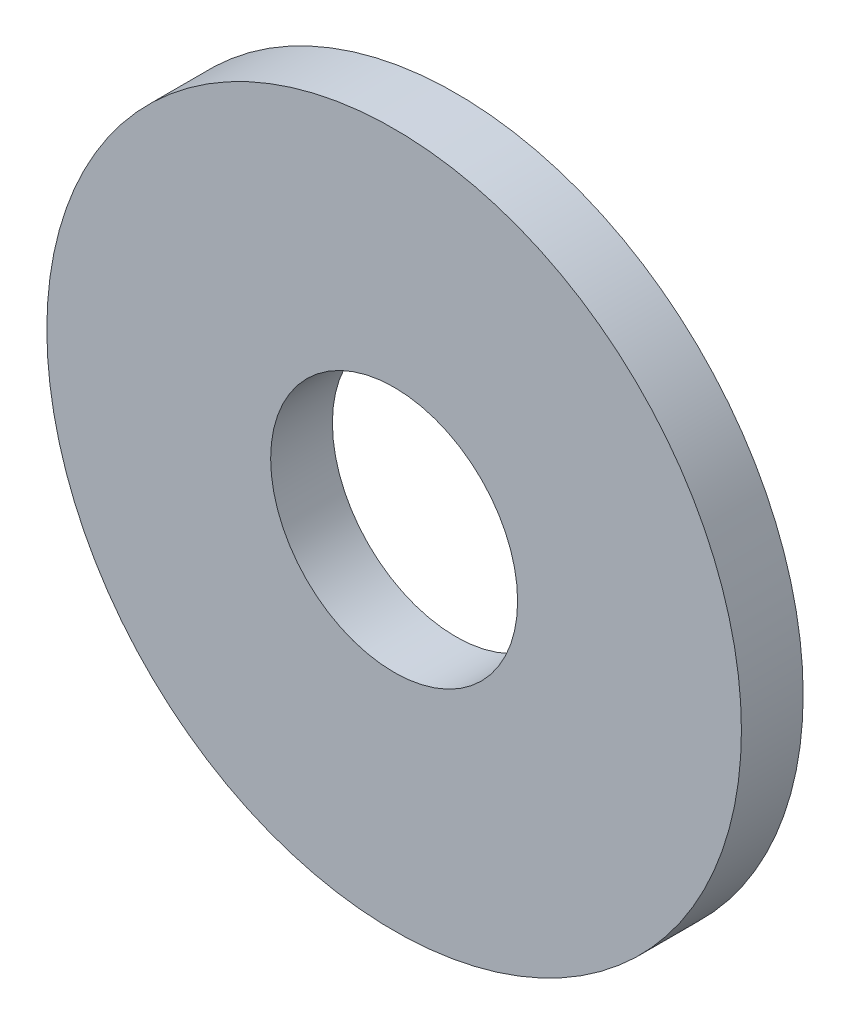
ISO-10303-21;
HEADER;
FILE_DESCRIPTION(('STEP AP214'),'2;1');
FILE_NAME('part.step','',(''),(''),'','','');
FILE_SCHEMA(('AUTOMOTIVE_DESIGN { 1 0 10303 214 1 1 1 1 }'));
ENDSEC;
DATA;
#1=APPLICATION_CONTEXT('core data for automotive mechanical design processes');
#2=APPLICATION_PROTOCOL_DEFINITION('international standard','automotive_design',2000,#1);
#3=PRODUCT_CONTEXT('',#1,'mechanical');
#4=PRODUCT('Part','Part','',(#3));
#5=PRODUCT_RELATED_PRODUCT_CATEGORY('part','',(#4));
#6=PRODUCT_DEFINITION_FORMATION('','',#4);
#7=PRODUCT_DEFINITION_CONTEXT('part definition',#1,'design');
#8=PRODUCT_DEFINITION('design','',#6,#7);
#9=PRODUCT_DEFINITION_SHAPE('','',#8);
#10=(LENGTH_UNIT() NAMED_UNIT(*) SI_UNIT(.MILLI.,.METRE.));
#11=(NAMED_UNIT(*) PLANE_ANGLE_UNIT() SI_UNIT($,.RADIAN.));
#12=(NAMED_UNIT(*) SI_UNIT($,.STERADIAN.) SOLID_ANGLE_UNIT());
#13=UNCERTAINTY_MEASURE_WITH_UNIT(LENGTH_MEASURE(1.E-05),#10,'distance_accuracy_value','');
#14=(GEOMETRIC_REPRESENTATION_CONTEXT(3) GLOBAL_UNCERTAINTY_ASSIGNED_CONTEXT((#13)) GLOBAL_UNIT_ASSIGNED_CONTEXT((#10,
#11,#12)) REPRESENTATION_CONTEXT('',''));
#15=CARTESIAN_POINT('',(0.,0.,0.));
#16=DIRECTION('',(0.,0.,1.));
#17=DIRECTION('',(1.,0.,0.));
#18=AXIS2_PLACEMENT_3D('',#15,#16,#17);
#19=CARTESIAN_POINT('',(0.,0.,0.4));
#20=DIRECTION('',(0.,0.,1.));
#21=DIRECTION('',(1.,0.,0.));
#22=AXIS2_PLACEMENT_3D('',#19,#20,#21);
#23=PLANE('',#22);
#24=CARTESIAN_POINT('',(0.,0.,0.4));
#25=DIRECTION('',(0.,0.,1.));
#26=DIRECTION('',(1.,0.,0.));
#27=AXIS2_PLACEMENT_3D('',#24,#25,#26);
#28=CIRCLE('',#27,4.5);
#29=CARTESIAN_POINT('',(4.5,0.,0.4));
#30=VERTEX_POINT('',#29);
#31=EDGE_CURVE('E10',#30,#30,#28,.T.);
#32=ORIENTED_EDGE('',*,*,#31,.T.);
#33=EDGE_LOOP('',(#32));
#34=FACE_BOUND('',#33,.T.);
#35=CARTESIAN_POINT('',(0.,0.,0.4));
#36=DIRECTION('',(0.,0.,1.));
#37=DIRECTION('',(1.,0.,0.));
#38=AXIS2_PLACEMENT_3D('',#35,#36,#37);
#39=CIRCLE('',#38,1.6);
#40=CARTESIAN_POINT('',(1.6,0.,0.4));
#41=VERTEX_POINT('',#40);
#42=EDGE_CURVE('E44',#41,#41,#39,.T.);
#43=ORIENTED_EDGE('',*,*,#42,.F.);
#44=EDGE_LOOP('',(#43));
#45=FACE_BOUND('',#44,.T.);
#46=ADVANCED_FACE('F33',(#34,#45),#23,.T.);
#47=CARTESIAN_POINT('',(0.,0.,-0.4));
#48=DIRECTION('',(0.,0.,1.));
#49=DIRECTION('',(1.,0.,0.));
#50=AXIS2_PLACEMENT_3D('',#47,#48,#49);
#51=PLANE('',#50);
#52=CARTESIAN_POINT('',(0.,0.,-0.4));
#53=DIRECTION('',(0.,0.,1.));
#54=DIRECTION('',(1.,0.,0.));
#55=AXIS2_PLACEMENT_3D('',#52,#53,#54);
#56=CIRCLE('',#55,4.5);
#57=CARTESIAN_POINT('',(4.5,0.,-0.4));
#58=VERTEX_POINT('',#57);
#59=EDGE_CURVE('E37',#58,#58,#56,.T.);
#60=ORIENTED_EDGE('',*,*,#59,.F.);
#61=EDGE_LOOP('',(#60));
#62=FACE_BOUND('',#61,.T.);
#63=CARTESIAN_POINT('',(0.,0.,-0.4));
#64=DIRECTION('',(0.,0.,1.));
#65=DIRECTION('',(1.,0.,0.));
#66=AXIS2_PLACEMENT_3D('',#63,#64,#65);
#67=CIRCLE('',#66,1.6);
#68=CARTESIAN_POINT('',(1.6,0.,-0.4));
#69=VERTEX_POINT('',#68);
#70=EDGE_CURVE('E46',#69,#69,#67,.T.);
#71=ORIENTED_EDGE('',*,*,#70,.T.);
#72=EDGE_LOOP('',(#71));
#73=FACE_BOUND('',#72,.T.);
#74=ADVANCED_FACE('F56',(#62,#73),#51,.F.);
#75=CARTESIAN_POINT('',(0.,0.,0.4));
#76=DIRECTION('',(0.,0.,-1.));
#77=DIRECTION('',(-1.,0.,0.));
#78=AXIS2_PLACEMENT_3D('',#75,#76,#77);
#79=CYLINDRICAL_SURFACE('',#78,4.5);
#80=ORIENTED_EDGE('',*,*,#31,.F.);
#81=EDGE_LOOP('',(#80));
#82=FACE_BOUND('',#81,.T.);
#83=ORIENTED_EDGE('',*,*,#59,.T.);
#84=EDGE_LOOP('',(#83));
#85=FACE_BOUND('',#84,.T.);
#86=ADVANCED_FACE('F35',(#82,#85),#79,.T.);
#87=CARTESIAN_POINT('',(0.,0.,0.4));
#88=DIRECTION('',(0.,0.,-1.));
#89=DIRECTION('',(-1.,0.,0.));
#90=AXIS2_PLACEMENT_3D('',#87,#88,#89);
#91=CYLINDRICAL_SURFACE('',#90,1.6);
#92=ORIENTED_EDGE('',*,*,#42,.T.);
#93=EDGE_LOOP('',(#92));
#94=FACE_BOUND('',#93,.T.);
#95=ORIENTED_EDGE('',*,*,#70,.F.);
#96=EDGE_LOOP('',(#95));
#97=FACE_BOUND('',#96,.T.);
#98=ADVANCED_FACE('F52',(#94,#97),#91,.F.);
#99=CLOSED_SHELL('',(#46,#74,#86,#98));
#100=MANIFOLD_SOLID_BREP('B2',#99);
#101=ADVANCED_BREP_SHAPE_REPRESENTATION('',(#18,#100),#14);
#102=SHAPE_DEFINITION_REPRESENTATION(#9,#101);
ENDSEC;
END-ISO-10303-21;
